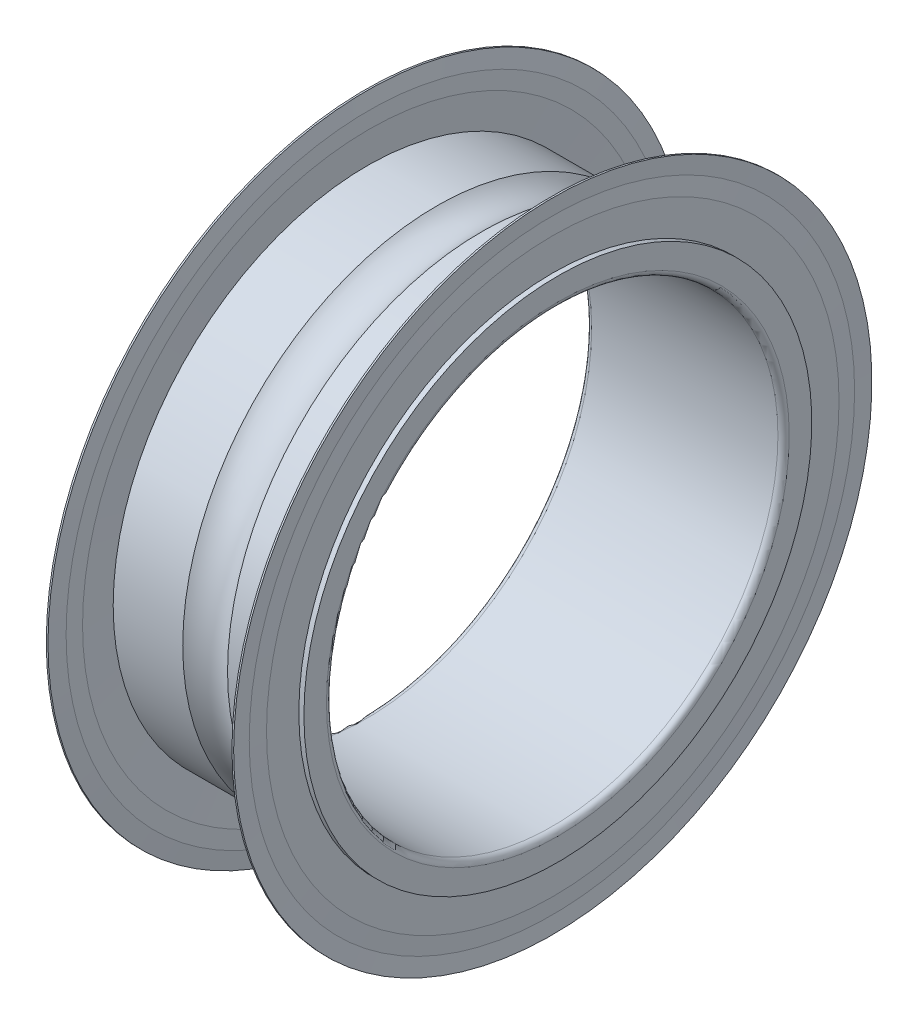
ISO-10303-21;
HEADER;
FILE_DESCRIPTION(('STEP AP214'),'2;1');
FILE_NAME('part.step','',(''),(''),'','','');
FILE_SCHEMA(('AUTOMOTIVE_DESIGN { 1 0 10303 214 1 1 1 1 }'));
ENDSEC;
DATA;
#1=APPLICATION_CONTEXT('core data for automotive mechanical design processes');
#2=APPLICATION_PROTOCOL_DEFINITION('international standard','automotive_design',2000,#1);
#3=PRODUCT_CONTEXT('',#1,'mechanical');
#4=PRODUCT('Part','Part','',(#3));
#5=PRODUCT_RELATED_PRODUCT_CATEGORY('part','',(#4));
#6=PRODUCT_DEFINITION_FORMATION('','',#4);
#7=PRODUCT_DEFINITION_CONTEXT('part definition',#1,'design');
#8=PRODUCT_DEFINITION('design','',#6,#7);
#9=PRODUCT_DEFINITION_SHAPE('','',#8);
#10=(LENGTH_UNIT() NAMED_UNIT(*) SI_UNIT(.MILLI.,.METRE.));
#11=(NAMED_UNIT(*) PLANE_ANGLE_UNIT() SI_UNIT($,.RADIAN.));
#12=(NAMED_UNIT(*) SI_UNIT($,.STERADIAN.) SOLID_ANGLE_UNIT());
#13=UNCERTAINTY_MEASURE_WITH_UNIT(LENGTH_MEASURE(1.E-05),#10,'distance_accuracy_value','');
#14=(GEOMETRIC_REPRESENTATION_CONTEXT(3) GLOBAL_UNCERTAINTY_ASSIGNED_CONTEXT((#13)) GLOBAL_UNIT_ASSIGNED_CONTEXT((#10,
#11,#12)) REPRESENTATION_CONTEXT('',''));
#15=CARTESIAN_POINT('',(0.,0.,0.));
#16=DIRECTION('',(0.,0.,1.));
#17=DIRECTION('',(1.,0.,0.));
#18=AXIS2_PLACEMENT_3D('',#15,#16,#17);
#19=CARTESIAN_POINT('',(0.,-4.5,-4.5));
#20=DIRECTION('',(-1.,0.,0.));
#21=DIRECTION('',(0.,0.,1.));
#22=AXIS2_PLACEMENT_3D('',#19,#20,#21);
#23=PLANE('',#22);
#24=CARTESIAN_POINT('',(0.,0.,0.));
#25=DIRECTION('',(-1.,0.,0.));
#26=DIRECTION('',(0.,0.,-1.));
#27=AXIS2_PLACEMENT_3D('',#24,#25,#26);
#28=CIRCLE('',#27,4.5);
#29=CARTESIAN_POINT('',(0.,0.,-4.5));
#30=VERTEX_POINT('',#29);
#31=EDGE_CURVE('E91',#30,#30,#28,.F.);
#32=ORIENTED_EDGE('',*,*,#31,.F.);
#33=EDGE_LOOP('',(#32));
#34=FACE_BOUND('',#33,.T.);
#35=CARTESIAN_POINT('',(0.,0.,0.));
#36=DIRECTION('',(1.,0.,0.));
#37=DIRECTION('',(0.,0.,1.));
#38=AXIS2_PLACEMENT_3D('',#35,#36,#37);
#39=CIRCLE('',#38,4.09999999999993);
#40=CARTESIAN_POINT('',(0.,0.,4.09999999999993));
#41=VERTEX_POINT('',#40);
#42=EDGE_CURVE('E88',#41,#41,#39,.T.);
#43=ORIENTED_EDGE('',*,*,#42,.T.);
#44=EDGE_LOOP('',(#43));
#45=FACE_BOUND('',#44,.T.);
#46=ADVANCED_FACE('F14',(#34,#45),#23,.T.);
#47=CARTESIAN_POINT('',(3.5,-4.5,4.5));
#48=DIRECTION('',(1.,0.,0.));
#49=DIRECTION('',(0.,0.,-1.));
#50=AXIS2_PLACEMENT_3D('',#47,#48,#49);
#51=PLANE('',#50);
#52=CARTESIAN_POINT('',(3.5,0.,0.));
#53=DIRECTION('',(1.,0.,0.));
#54=DIRECTION('',(0.,0.,1.));
#55=AXIS2_PLACEMENT_3D('',#52,#53,#54);
#56=CIRCLE('',#55,4.5);
#57=CARTESIAN_POINT('',(3.5,0.,4.5));
#58=VERTEX_POINT('',#57);
#59=EDGE_CURVE('E85',#58,#58,#56,.T.);
#60=ORIENTED_EDGE('',*,*,#59,.T.);
#61=EDGE_LOOP('',(#60));
#62=FACE_BOUND('',#61,.T.);
#63=CARTESIAN_POINT('',(3.5,0.,0.));
#64=DIRECTION('',(-1.,0.,0.));
#65=DIRECTION('',(0.,0.,-1.));
#66=AXIS2_PLACEMENT_3D('',#63,#64,#65);
#67=CIRCLE('',#66,4.1);
#68=CARTESIAN_POINT('',(3.5,0.,-4.1));
#69=VERTEX_POINT('',#68);
#70=EDGE_CURVE('E82',#69,#69,#67,.F.);
#71=ORIENTED_EDGE('',*,*,#70,.F.);
#72=EDGE_LOOP('',(#71));
#73=FACE_BOUND('',#72,.T.);
#74=ADVANCED_FACE('F100',(#62,#73),#51,.T.);
#75=CARTESIAN_POINT('',(0.09,-5.0725,-5.0725));
#76=DIRECTION('',(-1.,0.,0.));
#77=DIRECTION('',(0.,0.,1.));
#78=AXIS2_PLACEMENT_3D('',#75,#76,#77);
#79=PLANE('',#78);
#80=CARTESIAN_POINT('',(0.09,0.,0.));
#81=DIRECTION('',(-1.,0.,0.));
#82=DIRECTION('',(0.,0.,-1.));
#83=AXIS2_PLACEMENT_3D('',#80,#81,#82);
#84=CIRCLE('',#83,5.07250000000002);
#85=CARTESIAN_POINT('',(0.09,0.,-5.07250000000002));
#86=VERTEX_POINT('',#85);
#87=EDGE_CURVE('E79',#86,#86,#84,.F.);
#88=ORIENTED_EDGE('',*,*,#87,.F.);
#89=EDGE_LOOP('',(#88));
#90=FACE_BOUND('',#89,.T.);
#91=CARTESIAN_POINT('',(0.09,0.,0.));
#92=DIRECTION('',(1.,0.,0.));
#93=DIRECTION('',(0.,0.,1.));
#94=AXIS2_PLACEMENT_3D('',#91,#92,#93);
#95=CIRCLE('',#94,4.5);
#96=CARTESIAN_POINT('',(0.09,0.,4.5));
#97=VERTEX_POINT('',#96);
#98=EDGE_CURVE('E76',#97,#97,#95,.T.);
#99=ORIENTED_EDGE('',*,*,#98,.T.);
#100=EDGE_LOOP('',(#99));
#101=FACE_BOUND('',#100,.T.);
#102=ADVANCED_FACE('F314',(#90,#101),#79,.T.);
#103=CARTESIAN_POINT('',(0.15,-5.36375,5.36375));
#104=DIRECTION('',(1.,0.,0.));
#105=DIRECTION('',(0.,0.,-1.));
#106=AXIS2_PLACEMENT_3D('',#103,#104,#105);
#107=PLANE('',#106);
#108=CARTESIAN_POINT('',(0.15,0.,0.));
#109=DIRECTION('',(1.,0.,0.));
#110=DIRECTION('',(0.,0.,1.));
#111=AXIS2_PLACEMENT_3D('',#108,#109,#110);
#112=CIRCLE('',#111,5.36374999999997);
#113=CARTESIAN_POINT('',(0.15,0.,5.36374999999997));
#114=VERTEX_POINT('',#113);
#115=EDGE_CURVE('E73',#114,#114,#112,.T.);
#116=ORIENTED_EDGE('',*,*,#115,.T.);
#117=EDGE_LOOP('',(#116));
#118=FACE_BOUND('',#117,.T.);
#119=CARTESIAN_POINT('',(0.15,0.,0.));
#120=DIRECTION('',(-1.,0.,0.));
#121=DIRECTION('',(0.,0.,-1.));
#122=AXIS2_PLACEMENT_3D('',#119,#120,#121);
#123=CIRCLE('',#122,5.07250000000005);
#124=CARTESIAN_POINT('',(0.15,0.,-5.07250000000005));
#125=VERTEX_POINT('',#124);
#126=EDGE_CURVE('E70',#125,#125,#123,.F.);
#127=ORIENTED_EDGE('',*,*,#126,.F.);
#128=EDGE_LOOP('',(#127));
#129=FACE_BOUND('',#128,.T.);
#130=ADVANCED_FACE('F304',(#118,#129),#107,.T.);
#131=CARTESIAN_POINT('',(3.35,-5.36374999786228,-5.36375));
#132=DIRECTION('',(-1.,0.,0.));
#133=DIRECTION('',(0.,0.,1.));
#134=AXIS2_PLACEMENT_3D('',#131,#132,#133);
#135=PLANE('',#134);
#136=CARTESIAN_POINT('',(3.35,0.,0.));
#137=DIRECTION('',(-1.,0.,0.));
#138=DIRECTION('',(0.,0.,-1.));
#139=AXIS2_PLACEMENT_3D('',#136,#137,#138);
#140=CIRCLE('',#139,5.36375000000002);
#141=CARTESIAN_POINT('',(3.35,0.,-5.36375000000002));
#142=VERTEX_POINT('',#141);
#143=EDGE_CURVE('E67',#142,#142,#140,.F.);
#144=ORIENTED_EDGE('',*,*,#143,.F.);
#145=EDGE_LOOP('',(#144));
#146=FACE_BOUND('',#145,.T.);
#147=CARTESIAN_POINT('',(3.35,0.,0.));
#148=DIRECTION('',(1.,0.,0.));
#149=DIRECTION('',(0.,0.,1.));
#150=AXIS2_PLACEMENT_3D('',#147,#148,#149);
#151=CIRCLE('',#150,5.0725);
#152=CARTESIAN_POINT('',(3.35,0.,5.0725));
#153=VERTEX_POINT('',#152);
#154=EDGE_CURVE('E64',#153,#153,#151,.T.);
#155=ORIENTED_EDGE('',*,*,#154,.T.);
#156=EDGE_LOOP('',(#155));
#157=FACE_BOUND('',#156,.T.);
#158=ADVANCED_FACE('F294',(#146,#157),#135,.T.);
#159=CARTESIAN_POINT('',(3.41,-5.0725,5.0725));
#160=DIRECTION('',(1.,0.,0.));
#161=DIRECTION('',(0.,0.,-1.));
#162=AXIS2_PLACEMENT_3D('',#159,#160,#161);
#163=PLANE('',#162);
#164=CARTESIAN_POINT('',(3.41,0.,0.));
#165=DIRECTION('',(1.,0.,0.));
#166=DIRECTION('',(0.,0.,1.));
#167=AXIS2_PLACEMENT_3D('',#164,#165,#166);
#168=CIRCLE('',#167,5.0725);
#169=CARTESIAN_POINT('',(3.41,0.,5.0725));
#170=VERTEX_POINT('',#169);
#171=EDGE_CURVE('E61',#170,#170,#168,.T.);
#172=ORIENTED_EDGE('',*,*,#171,.T.);
#173=EDGE_LOOP('',(#172));
#174=FACE_BOUND('',#173,.T.);
#175=CARTESIAN_POINT('',(3.41,0.,0.));
#176=DIRECTION('',(-1.,0.,0.));
#177=DIRECTION('',(0.,0.,-1.));
#178=AXIS2_PLACEMENT_3D('',#175,#176,#177);
#179=CIRCLE('',#178,4.5);
#180=CARTESIAN_POINT('',(3.41,0.,-4.5));
#181=VERTEX_POINT('',#180);
#182=EDGE_CURVE('E58',#181,#181,#179,.T.);
#183=ORIENTED_EDGE('',*,*,#182,.T.);
#184=EDGE_LOOP('',(#183));
#185=FACE_BOUND('',#184,.T.);
#186=ADVANCED_FACE('F285',(#174,#185),#163,.T.);
#187=CARTESIAN_POINT('',(50.,0.,0.));
#188=DIRECTION('',(1.,0.,0.));
#189=DIRECTION('',(0.,1.92313842968669E-10,1.));
#190=AXIS2_PLACEMENT_3D('',#187,#188,#189);
#191=CYLINDRICAL_SURFACE('',#190,4.5);
#192=CARTESIAN_POINT('',(2.1468626966597,0.,0.));
#193=DIRECTION('',(1.,0.,0.));
#194=DIRECTION('',(0.,0.,1.));
#195=AXIS2_PLACEMENT_3D('',#192,#193,#194);
#196=CIRCLE('',#195,4.5);
#197=CARTESIAN_POINT('',(2.1468626966597,0.,4.5));
#198=VERTEX_POINT('',#197);
#199=EDGE_CURVE('E55',#198,#198,#196,.T.);
#200=ORIENTED_EDGE('',*,*,#199,.T.);
#201=EDGE_LOOP('',(#200));
#202=FACE_BOUND('',#201,.T.);
#203=CARTESIAN_POINT('',(3.37948497854077,0.,0.));
#204=DIRECTION('',(-1.,0.,0.));
#205=DIRECTION('',(0.,0.,-1.));
#206=AXIS2_PLACEMENT_3D('',#203,#204,#205);
#207=CIRCLE('',#206,4.5);
#208=CARTESIAN_POINT('',(3.37948497854077,0.,-4.5));
#209=VERTEX_POINT('',#208);
#210=EDGE_CURVE('E52',#209,#209,#207,.F.);
#211=ORIENTED_EDGE('',*,*,#210,.F.);
#212=EDGE_LOOP('',(#211));
#213=FACE_BOUND('',#212,.T.);
#214=ADVANCED_FACE('F117',(#202,#213),#191,.T.);
#215=CARTESIAN_POINT('',(50.,0.,0.));
#216=DIRECTION('',(1.,0.,0.));
#217=DIRECTION('',(0.,0.,1.));
#218=AXIS2_PLACEMENT_3D('',#215,#216,#217);
#219=CYLINDRICAL_SURFACE('',#218,4.5);
#220=ORIENTED_EDGE('',*,*,#31,.T.);
#221=EDGE_LOOP('',(#220));
#222=FACE_BOUND('',#221,.T.);
#223=ORIENTED_EDGE('',*,*,#98,.F.);
#224=EDGE_LOOP('',(#223));
#225=FACE_BOUND('',#224,.T.);
#226=ADVANCED_FACE('F95',(#222,#225),#219,.T.);
#227=CARTESIAN_POINT('',(0.0999999999999217,0.,0.));
#228=DIRECTION('',(1.,0.,0.));
#229=DIRECTION('',(0.,0.,1.));
#230=AXIS2_PLACEMENT_3D('',#227,#228,#229);
#231=TOROIDAL_SURFACE('',#230,4.09999999999993,0.0999999999999217);
#232=CARTESIAN_POINT('',(0.100000000000003,0.,0.));
#233=DIRECTION('',(1.,0.,0.));
#234=DIRECTION('',(0.,0.,1.));
#235=AXIS2_PLACEMENT_3D('',#232,#233,#234);
#236=CIRCLE('',#235,4.);
#237=CARTESIAN_POINT('',(0.100000000000003,0.,4.));
#238=VERTEX_POINT('',#237);
#239=EDGE_CURVE('E49',#238,#238,#236,.T.);
#240=ORIENTED_EDGE('',*,*,#239,.T.);
#241=EDGE_LOOP('',(#240));
#242=FACE_BOUND('',#241,.T.);
#243=ORIENTED_EDGE('',*,*,#42,.F.);
#244=EDGE_LOOP('',(#243));
#245=FACE_BOUND('',#244,.T.);
#246=ADVANCED_FACE('F104',(#242,#245),#231,.T.);
#247=CARTESIAN_POINT('',(50.,0.,0.));
#248=DIRECTION('',(1.,0.,0.));
#249=DIRECTION('',(0.,0.,1.));
#250=AXIS2_PLACEMENT_3D('',#247,#248,#249);
#251=CYLINDRICAL_SURFACE('',#250,4.);
#252=CARTESIAN_POINT('',(3.4,0.,0.));
#253=DIRECTION('',(1.,0.,0.));
#254=DIRECTION('',(0.,0.,1.));
#255=AXIS2_PLACEMENT_3D('',#252,#253,#254);
#256=CIRCLE('',#255,4.);
#257=CARTESIAN_POINT('',(3.4,0.,4.));
#258=VERTEX_POINT('',#257);
#259=EDGE_CURVE('E46',#258,#258,#256,.T.);
#260=ORIENTED_EDGE('',*,*,#259,.T.);
#261=EDGE_LOOP('',(#260));
#262=FACE_BOUND('',#261,.T.);
#263=ORIENTED_EDGE('',*,*,#239,.F.);
#264=EDGE_LOOP('',(#263));
#265=FACE_BOUND('',#264,.T.);
#266=ADVANCED_FACE('F106',(#262,#265),#251,.F.);
#267=CARTESIAN_POINT('',(3.40000000000015,0.,0.));
#268=DIRECTION('',(1.,0.,0.));
#269=DIRECTION('',(0.,1.4241886393574E-07,0.99999999999999));
#270=AXIS2_PLACEMENT_3D('',#267,#268,#269);
#271=TOROIDAL_SURFACE('',#270,4.09999999999985,0.099999999999845);
#272=ORIENTED_EDGE('',*,*,#70,.T.);
#273=EDGE_LOOP('',(#272));
#274=FACE_BOUND('',#273,.T.);
#275=ORIENTED_EDGE('',*,*,#259,.F.);
#276=EDGE_LOOP('',(#275));
#277=FACE_BOUND('',#276,.T.);
#278=ADVANCED_FACE('F114',(#274,#277),#271,.T.);
#279=CARTESIAN_POINT('',(50.,0.,0.));
#280=DIRECTION('',(1.,0.,0.));
#281=DIRECTION('',(0.,0.,1.));
#282=AXIS2_PLACEMENT_3D('',#279,#280,#281);
#283=CYLINDRICAL_SURFACE('',#282,4.5);
#284=ORIENTED_EDGE('',*,*,#182,.F.);
#285=EDGE_LOOP('',(#284));
#286=FACE_BOUND('',#285,.T.);
#287=ORIENTED_EDGE('',*,*,#59,.F.);
#288=EDGE_LOOP('',(#287));
#289=FACE_BOUND('',#288,.T.);
#290=ADVANCED_FACE('F123',(#286,#289),#283,.T.);
#291=CARTESIAN_POINT('',(1.75,0.,0.));
#292=DIRECTION('',(1.,0.,0.));
#293=DIRECTION('',(0.,0.,1.));
#294=AXIS2_PLACEMENT_3D('',#291,#292,#293);
#295=TOROIDAL_SURFACE('',#294,4.95,0.600000000000028);
#296=ORIENTED_EDGE('',*,*,#199,.F.);
#297=EDGE_LOOP('',(#296));
#298=FACE_BOUND('',#297,.T.);
#299=CARTESIAN_POINT('',(1.35313730334029,0.,0.));
#300=DIRECTION('',(1.,0.,0.));
#301=DIRECTION('',(0.,0.,1.));
#302=AXIS2_PLACEMENT_3D('',#299,#300,#301);
#303=CIRCLE('',#302,4.49999999999998);
#304=CARTESIAN_POINT('',(1.35313730334029,0.,4.49999999999998));
#305=VERTEX_POINT('',#304);
#306=EDGE_CURVE('E43',#305,#305,#303,.T.);
#307=ORIENTED_EDGE('',*,*,#306,.T.);
#308=EDGE_LOOP('',(#307));
#309=FACE_BOUND('',#308,.T.);
#310=ADVANCED_FACE('F127',(#298,#309),#295,.F.);
#311=CARTESIAN_POINT('',(50.,0.,0.));
#312=DIRECTION('',(1.,0.,0.));
#313=DIRECTION('',(0.,0.,1.));
#314=AXIS2_PLACEMENT_3D('',#311,#312,#313);
#315=CYLINDRICAL_SURFACE('',#314,4.5);
#316=CARTESIAN_POINT('',(0.120515021459227,0.,0.));
#317=DIRECTION('',(1.,0.,0.));
#318=DIRECTION('',(0.,0.,1.));
#319=AXIS2_PLACEMENT_3D('',#316,#317,#318);
#320=CIRCLE('',#319,4.5);
#321=CARTESIAN_POINT('',(0.120515021459227,0.,4.5));
#322=VERTEX_POINT('',#321);
#323=EDGE_CURVE('E40',#322,#322,#320,.F.);
#324=ORIENTED_EDGE('',*,*,#323,.F.);
#325=EDGE_LOOP('',(#324));
#326=FACE_BOUND('',#325,.T.);
#327=ORIENTED_EDGE('',*,*,#306,.F.);
#328=EDGE_LOOP('',(#327));
#329=FACE_BOUND('',#328,.T.);
#330=ADVANCED_FACE('F131',(#326,#329),#315,.T.);
#331=CARTESIAN_POINT('',(50.,0.,0.));
#332=DIRECTION('',(1.,0.,0.));
#333=DIRECTION('',(0.,1.92347593748618E-10,1.));
#334=AXIS2_PLACEMENT_3D('',#331,#332,#333);
#335=CYLINDRICAL_SURFACE('',#334,5.655);
#336=CARTESIAN_POINT('',(0.0900000000000034,0.,0.));
#337=DIRECTION('',(1.,0.,0.));
#338=DIRECTION('',(0.,0.,1.));
#339=AXIS2_PLACEMENT_3D('',#336,#337,#338);
#340=CIRCLE('',#339,5.655);
#341=CARTESIAN_POINT('',(0.0900000000000034,0.,5.655));
#342=VERTEX_POINT('',#341);
#343=EDGE_CURVE('E37',#342,#342,#340,.T.);
#344=ORIENTED_EDGE('',*,*,#343,.T.);
#345=EDGE_LOOP('',(#344));
#346=FACE_BOUND('',#345,.T.);
#347=CARTESIAN_POINT('',(0.120000000000005,0.,0.));
#348=DIRECTION('',(-1.,0.,0.));
#349=DIRECTION('',(0.,0.,-1.));
#350=AXIS2_PLACEMENT_3D('',#347,#348,#349);
#351=CIRCLE('',#350,5.655);
#352=CARTESIAN_POINT('',(0.120000000000005,0.,-5.655));
#353=VERTEX_POINT('',#352);
#354=EDGE_CURVE('E34',#353,#353,#351,.F.);
#355=ORIENTED_EDGE('',*,*,#354,.F.);
#356=EDGE_LOOP('',(#355));
#357=FACE_BOUND('',#356,.T.);
#358=ADVANCED_FACE('F135',(#346,#357),#335,.T.);
#359=CARTESIAN_POINT('',(0.09,0.,0.));
#360=DIRECTION('',(-1.,0.,0.));
#361=DIRECTION('',(0.,0.,-1.));
#362=AXIS2_PLACEMENT_3D('',#359,#360,#361);
#363=CONICAL_SURFACE('',#362,5.655,1.51933964452287);
#364=ORIENTED_EDGE('',*,*,#343,.F.);
#365=EDGE_LOOP('',(#364));
#366=FACE_BOUND('',#365,.T.);
#367=CARTESIAN_POINT('',(0.105000000000001,0.,0.));
#368=DIRECTION('',(1.,0.,0.));
#369=DIRECTION('',(0.,0.,1.));
#370=AXIS2_PLACEMENT_3D('',#367,#368,#369);
#371=CIRCLE('',#370,5.36375);
#372=CARTESIAN_POINT('',(0.105000000000001,0.,5.36375));
#373=VERTEX_POINT('',#372);
#374=EDGE_CURVE('E29',#373,#373,#371,.T.);
#375=ORIENTED_EDGE('',*,*,#374,.T.);
#376=EDGE_LOOP('',(#375));
#377=FACE_BOUND('',#376,.T.);
#378=ADVANCED_FACE('F139',(#366,#377),#363,.F.);
#379=CARTESIAN_POINT('',(0.105,0.,0.));
#380=DIRECTION('',(1.,0.,0.));
#381=DIRECTION('',(0.,0.,1.));
#382=AXIS2_PLACEMENT_3D('',#379,#380,#381);
#383=CONICAL_SURFACE('',#382,5.36375,1.51933964452287);
#384=ORIENTED_EDGE('',*,*,#87,.T.);
#385=EDGE_LOOP('',(#384));
#386=FACE_BOUND('',#385,.T.);
#387=ORIENTED_EDGE('',*,*,#374,.F.);
#388=EDGE_LOOP('',(#387));
#389=FACE_BOUND('',#388,.T.);
#390=ADVANCED_FACE('F143',(#386,#389),#383,.T.);
#391=CARTESIAN_POINT('',(0.149999999999997,0.,0.));
#392=DIRECTION('',(1.,0.,0.));
#393=DIRECTION('',(0.,0.,1.));
#394=AXIS2_PLACEMENT_3D('',#391,#392,#393);
#395=CONICAL_SURFACE('',#394,5.0725,1.51933964452288);
#396=ORIENTED_EDGE('',*,*,#126,.T.);
#397=EDGE_LOOP('',(#396));
#398=FACE_BOUND('',#397,.T.);
#399=ORIENTED_EDGE('',*,*,#323,.T.);
#400=EDGE_LOOP('',(#399));
#401=FACE_BOUND('',#400,.T.);
#402=ADVANCED_FACE('F147',(#398,#401),#395,.F.);
#403=CARTESIAN_POINT('',(0.120000000000002,0.,0.));
#404=DIRECTION('',(-1.,0.,0.));
#405=DIRECTION('',(0.,0.,-1.));
#406=AXIS2_PLACEMENT_3D('',#403,#404,#405);
#407=CONICAL_SURFACE('',#406,5.655,1.46815402121657);
#408=ORIENTED_EDGE('',*,*,#354,.T.);
#409=EDGE_LOOP('',(#408));
#410=FACE_BOUND('',#409,.T.);
#411=ORIENTED_EDGE('',*,*,#115,.F.);
#412=EDGE_LOOP('',(#411));
#413=FACE_BOUND('',#412,.T.);
#414=ADVANCED_FACE('F151',(#410,#413),#407,.T.);
#415=CARTESIAN_POINT('',(3.38,0.,0.));
#416=DIRECTION('',(1.,0.,0.));
#417=DIRECTION('',(0.,1.16845478882064E-09,1.));
#418=AXIS2_PLACEMENT_3D('',#415,#416,#417);
#419=CONICAL_SURFACE('',#418,5.655,1.46815402121655);
#420=ORIENTED_EDGE('',*,*,#143,.T.);
#421=EDGE_LOOP('',(#420));
#422=FACE_BOUND('',#421,.T.);
#423=CARTESIAN_POINT('',(3.38,0.,0.));
#424=DIRECTION('',(-1.,0.,0.));
#425=DIRECTION('',(0.,0.,-1.));
#426=AXIS2_PLACEMENT_3D('',#423,#424,#425);
#427=CIRCLE('',#426,5.655);
#428=CARTESIAN_POINT('',(3.38,0.,-5.655));
#429=VERTEX_POINT('',#428);
#430=EDGE_CURVE('E25',#429,#429,#427,.F.);
#431=ORIENTED_EDGE('',*,*,#430,.F.);
#432=EDGE_LOOP('',(#431));
#433=FACE_BOUND('',#432,.T.);
#434=ADVANCED_FACE('F155',(#422,#433),#419,.T.);
#435=CARTESIAN_POINT('',(3.35,0.,0.));
#436=DIRECTION('',(-1.,0.,0.));
#437=DIRECTION('',(0.,0.,-1.));
#438=AXIS2_PLACEMENT_3D('',#435,#436,#437);
#439=CONICAL_SURFACE('',#438,5.07250000000001,1.51933964452287);
#440=ORIENTED_EDGE('',*,*,#210,.T.);
#441=EDGE_LOOP('',(#440));
#442=FACE_BOUND('',#441,.T.);
#443=ORIENTED_EDGE('',*,*,#154,.F.);
#444=EDGE_LOOP('',(#443));
#445=FACE_BOUND('',#444,.T.);
#446=ADVANCED_FACE('F159',(#442,#445),#439,.F.);
#447=CARTESIAN_POINT('',(3.395,0.,0.));
#448=DIRECTION('',(-1.,0.,0.));
#449=DIRECTION('',(0.,0.,-1.));
#450=AXIS2_PLACEMENT_3D('',#447,#448,#449);
#451=CONICAL_SURFACE('',#450,5.36375,1.51933964452287);
#452=ORIENTED_EDGE('',*,*,#171,.F.);
#453=EDGE_LOOP('',(#452));
#454=FACE_BOUND('',#453,.T.);
#455=CARTESIAN_POINT('',(3.395,0.,0.));
#456=DIRECTION('',(1.,0.,0.));
#457=DIRECTION('',(0.,0.,1.));
#458=AXIS2_PLACEMENT_3D('',#455,#456,#457);
#459=CIRCLE('',#458,5.36375);
#460=CARTESIAN_POINT('',(3.395,0.,5.36375));
#461=VERTEX_POINT('',#460);
#462=EDGE_CURVE('E21',#461,#461,#459,.T.);
#463=ORIENTED_EDGE('',*,*,#462,.T.);
#464=EDGE_LOOP('',(#463));
#465=FACE_BOUND('',#464,.T.);
#466=ADVANCED_FACE('F163',(#454,#465),#451,.T.);
#467=CARTESIAN_POINT('',(3.41,0.,0.));
#468=DIRECTION('',(1.,0.,0.));
#469=DIRECTION('',(0.,0.,1.));
#470=AXIS2_PLACEMENT_3D('',#467,#468,#469);
#471=CONICAL_SURFACE('',#470,5.655,1.51933964452287);
#472=CARTESIAN_POINT('',(3.41,0.,0.));
#473=DIRECTION('',(1.,0.,0.));
#474=DIRECTION('',(0.,0.,1.));
#475=AXIS2_PLACEMENT_3D('',#472,#473,#474);
#476=CIRCLE('',#475,5.655);
#477=CARTESIAN_POINT('',(3.41,0.,5.655));
#478=VERTEX_POINT('',#477);
#479=EDGE_CURVE('E10',#478,#478,#476,.T.);
#480=ORIENTED_EDGE('',*,*,#479,.T.);
#481=EDGE_LOOP('',(#480));
#482=FACE_BOUND('',#481,.T.);
#483=ORIENTED_EDGE('',*,*,#462,.F.);
#484=EDGE_LOOP('',(#483));
#485=FACE_BOUND('',#484,.T.);
#486=ADVANCED_FACE('F166',(#482,#485),#471,.F.);
#487=CARTESIAN_POINT('',(50.,0.,0.));
#488=DIRECTION('',(1.,0.,0.));
#489=DIRECTION('',(0.,0.,1.));
#490=AXIS2_PLACEMENT_3D('',#487,#488,#489);
#491=CYLINDRICAL_SURFACE('',#490,5.655);
#492=ORIENTED_EDGE('',*,*,#430,.T.);
#493=EDGE_LOOP('',(#492));
#494=FACE_BOUND('',#493,.T.);
#495=ORIENTED_EDGE('',*,*,#479,.F.);
#496=EDGE_LOOP('',(#495));
#497=FACE_BOUND('',#496,.T.);
#498=ADVANCED_FACE('F16',(#494,#497),#491,.T.);
#499=CLOSED_SHELL('',(#46,#74,#102,#130,#158,#186,#214,#226,#246,#266,#278,#290,#310,#330,#358,
#378,#390,#402,#414,#434,#446,#466,#486,#498));
#500=MANIFOLD_SOLID_BREP('B1',#499);
#501=ADVANCED_BREP_SHAPE_REPRESENTATION('',(#18,#500),#14);
#502=SHAPE_DEFINITION_REPRESENTATION(#9,#501);
ENDSEC;
END-ISO-10303-21;
